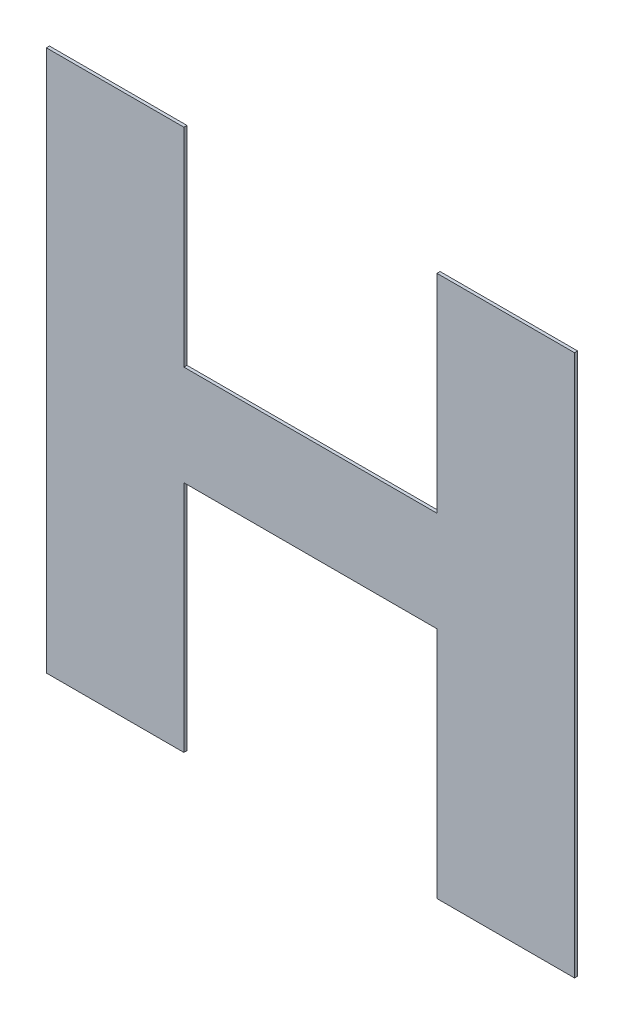
ISO-10303-21;
HEADER;
FILE_DESCRIPTION(('STEP AP214'),'2;1');
FILE_NAME('part.step','',(''),(''),'','','');
FILE_SCHEMA(('AUTOMOTIVE_DESIGN { 1 0 10303 214 1 1 1 1 }'));
ENDSEC;
DATA;
#1=APPLICATION_CONTEXT('core data for automotive mechanical design processes');
#2=APPLICATION_PROTOCOL_DEFINITION('international standard','automotive_design',2000,#1);
#3=PRODUCT_CONTEXT('',#1,'mechanical');
#4=PRODUCT('Part','Part','',(#3));
#5=PRODUCT_RELATED_PRODUCT_CATEGORY('part','',(#4));
#6=PRODUCT_DEFINITION_FORMATION('','',#4);
#7=PRODUCT_DEFINITION_CONTEXT('part definition',#1,'design');
#8=PRODUCT_DEFINITION('design','',#6,#7);
#9=PRODUCT_DEFINITION_SHAPE('','',#8);
#10=(LENGTH_UNIT() NAMED_UNIT(*) SI_UNIT(.MILLI.,.METRE.));
#11=(NAMED_UNIT(*) PLANE_ANGLE_UNIT() SI_UNIT($,.RADIAN.));
#12=(NAMED_UNIT(*) SI_UNIT($,.STERADIAN.) SOLID_ANGLE_UNIT());
#13=UNCERTAINTY_MEASURE_WITH_UNIT(LENGTH_MEASURE(1.E-05),#10,'distance_accuracy_value','');
#14=(GEOMETRIC_REPRESENTATION_CONTEXT(3) GLOBAL_UNCERTAINTY_ASSIGNED_CONTEXT((#13)) GLOBAL_UNIT_ASSIGNED_CONTEXT((#10,
#11,#12)) REPRESENTATION_CONTEXT('',''));
#15=CARTESIAN_POINT('',(0.,0.,0.));
#16=DIRECTION('',(0.,0.,1.));
#17=DIRECTION('',(1.,0.,0.));
#18=AXIS2_PLACEMENT_3D('',#15,#16,#17);
#19=CARTESIAN_POINT('',(-0.0645240321740251,0.7412429894471,0.0009));
#20=DIRECTION('',(0.,1.,0.));
#21=DIRECTION('',(0.,0.,1.));
#22=AXIS2_PLACEMENT_3D('',#19,#20,#21);
#23=PLANE('',#22);
#24=DIRECTION('',(0.,0.,1.));
#25=VECTOR('',#24,1.);
#26=CARTESIAN_POINT('',(-0.0845298786240001,0.7412429894471,0.));
#27=LINE('',#26,#25);
#28=CARTESIAN_POINT('',(-0.0845298786240001,0.7412429894471,0.));
#29=VERTEX_POINT('',#28);
#30=CARTESIAN_POINT('',(-0.0845298786240001,0.7412429894471,0.0009));
#31=VERTEX_POINT('',#30);
#32=EDGE_CURVE('E11',#29,#31,#27,.T.);
#33=ORIENTED_EDGE('',*,*,#32,.T.);
#34=DIRECTION('',(1.,0.,0.));
#35=VECTOR('',#34,1.);
#36=CARTESIAN_POINT('',(-0.0845298786240001,0.7412429894471,0.0009));
#37=LINE('',#36,#35);
#38=CARTESIAN_POINT('',(-0.0445181857240501,0.7412429894471,0.0009));
#39=VERTEX_POINT('',#38);
#40=EDGE_CURVE('E199',#31,#39,#37,.T.);
#41=ORIENTED_EDGE('',*,*,#40,.T.);
#42=DIRECTION('',(0.,0.,1.));
#43=VECTOR('',#42,1.);
#44=CARTESIAN_POINT('',(-0.0445181857240501,0.7412429894471,0.));
#45=LINE('',#44,#43);
#46=CARTESIAN_POINT('',(-0.0445181857240501,0.7412429894471,0.));
#47=VERTEX_POINT('',#46);
#48=EDGE_CURVE('E24',#47,#39,#45,.T.);
#49=ORIENTED_EDGE('',*,*,#48,.F.);
#50=DIRECTION('',(1.,0.,0.));
#51=VECTOR('',#50,1.);
#52=CARTESIAN_POINT('',(-0.0845298786240001,0.7412429894471,0.));
#53=LINE('',#52,#51);
#54=EDGE_CURVE('E188',#29,#47,#53,.T.);
#55=ORIENTED_EDGE('',*,*,#54,.F.);
#56=EDGE_LOOP('',(#33,#41,#49,#55));
#57=FACE_BOUND('',#56,.T.);
#58=ADVANCED_FACE('F17',(#57),#23,.T.);
#59=CARTESIAN_POINT('',(-0.0445181857240501,0.71101175133205,0.0009));
#60=DIRECTION('',(1.,0.,0.));
#61=DIRECTION('',(0.,0.,-1.));
#62=AXIS2_PLACEMENT_3D('',#59,#60,#61);
#63=PLANE('',#62);
#64=ORIENTED_EDGE('',*,*,#48,.T.);
#65=DIRECTION('',(0.,-1.,0.));
#66=VECTOR('',#65,1.);
#67=CARTESIAN_POINT('',(-0.0445181857240501,0.7412429894471,0.0009));
#68=LINE('',#67,#66);
#69=CARTESIAN_POINT('',(-0.0445181857240501,0.680780513216999,0.0009));
#70=VERTEX_POINT('',#69);
#71=EDGE_CURVE('E195',#39,#70,#68,.T.);
#72=ORIENTED_EDGE('',*,*,#71,.T.);
#73=DIRECTION('',(0.,0.,1.));
#74=VECTOR('',#73,1.);
#75=CARTESIAN_POINT('',(-0.0445181857240501,0.680780513216999,0.));
#76=LINE('',#75,#74);
#77=CARTESIAN_POINT('',(-0.0445181857240501,0.680780513216999,0.));
#78=VERTEX_POINT('',#77);
#79=EDGE_CURVE('E197',#78,#70,#76,.T.);
#80=ORIENTED_EDGE('',*,*,#79,.F.);
#81=DIRECTION('',(0.,-1.,0.));
#82=VECTOR('',#81,1.);
#83=CARTESIAN_POINT('',(-0.0445181857240501,0.7412429894471,0.));
#84=LINE('',#83,#82);
#85=EDGE_CURVE('E180',#47,#78,#84,.T.);
#86=ORIENTED_EDGE('',*,*,#85,.F.);
#87=EDGE_LOOP('',(#64,#72,#80,#86));
#88=FACE_BOUND('',#87,.T.);
#89=ADVANCED_FACE('F206',(#88),#63,.T.);
#90=CARTESIAN_POINT('',(-0.00768402012397513,0.680780513216999,0.0009));
#91=DIRECTION('',(0.,1.,0.));
#92=DIRECTION('',(0.,0.,1.));
#93=AXIS2_PLACEMENT_3D('',#90,#91,#92);
#94=PLANE('',#93);
#95=ORIENTED_EDGE('',*,*,#79,.T.);
#96=DIRECTION('',(1.,0.,0.));
#97=VECTOR('',#96,1.);
#98=CARTESIAN_POINT('',(-0.0445181857240501,0.680780513216999,0.0009));
#99=LINE('',#98,#97);
#100=CARTESIAN_POINT('',(0.0291501454760999,0.680780513216999,0.0009));
#101=VERTEX_POINT('',#100);
#102=EDGE_CURVE('E190',#70,#101,#99,.T.);
#103=ORIENTED_EDGE('',*,*,#102,.T.);
#104=DIRECTION('',(0.,0.,1.));
#105=VECTOR('',#104,1.);
#106=CARTESIAN_POINT('',(0.0291501454760999,0.680780513216999,0.));
#107=LINE('',#106,#105);
#108=CARTESIAN_POINT('',(0.0291501454760999,0.680780513216999,0.));
#109=VERTEX_POINT('',#108);
#110=EDGE_CURVE('E193',#109,#101,#107,.T.);
#111=ORIENTED_EDGE('',*,*,#110,.F.);
#112=DIRECTION('',(1.,0.,0.));
#113=VECTOR('',#112,1.);
#114=CARTESIAN_POINT('',(-0.0445181857240501,0.680780513216999,0.));
#115=LINE('',#114,#113);
#116=EDGE_CURVE('E172',#78,#109,#115,.T.);
#117=ORIENTED_EDGE('',*,*,#116,.F.);
#118=EDGE_LOOP('',(#95,#103,#111,#117));
#119=FACE_BOUND('',#118,.T.);
#120=ADVANCED_FACE('F209',(#119),#94,.T.);
#121=CARTESIAN_POINT('',(0.0291501454760999,0.71101175133205,0.0009));
#122=DIRECTION('',(-1.,0.,0.));
#123=DIRECTION('',(0.,0.,1.));
#124=AXIS2_PLACEMENT_3D('',#121,#122,#123);
#125=PLANE('',#124);
#126=ORIENTED_EDGE('',*,*,#110,.T.);
#127=DIRECTION('',(0.,1.,0.));
#128=VECTOR('',#127,1.);
#129=CARTESIAN_POINT('',(0.0291501454760999,0.680780513216999,0.0009));
#130=LINE('',#129,#128);
#131=CARTESIAN_POINT('',(0.0291501454760999,0.7412429894471,0.0009));
#132=VERTEX_POINT('',#131);
#133=EDGE_CURVE('E183',#101,#132,#130,.T.);
#134=ORIENTED_EDGE('',*,*,#133,.T.);
#135=DIRECTION('',(0.,0.,1.));
#136=VECTOR('',#135,1.);
#137=CARTESIAN_POINT('',(0.0291501454760999,0.7412429894471,0.));
#138=LINE('',#137,#136);
#139=CARTESIAN_POINT('',(0.0291501454760999,0.7412429894471,0.));
#140=VERTEX_POINT('',#139);
#141=EDGE_CURVE('E186',#140,#132,#138,.T.);
#142=ORIENTED_EDGE('',*,*,#141,.F.);
#143=DIRECTION('',(0.,1.,0.));
#144=VECTOR('',#143,1.);
#145=CARTESIAN_POINT('',(0.0291501454760999,0.680780513216999,0.));
#146=LINE('',#145,#144);
#147=EDGE_CURVE('E164',#109,#140,#146,.T.);
#148=ORIENTED_EDGE('',*,*,#147,.F.);
#149=EDGE_LOOP('',(#126,#134,#142,#148));
#150=FACE_BOUND('',#149,.T.);
#151=ADVANCED_FACE('F213',(#150),#125,.T.);
#152=CARTESIAN_POINT('',(0.0491620879259999,0.7412429894471,0.0009));
#153=DIRECTION('',(0.,1.,0.));
#154=DIRECTION('',(0.,0.,1.));
#155=AXIS2_PLACEMENT_3D('',#152,#153,#154);
#156=PLANE('',#155);
#157=ORIENTED_EDGE('',*,*,#141,.T.);
#158=DIRECTION('',(1.,0.,0.));
#159=VECTOR('',#158,1.);
#160=CARTESIAN_POINT('',(0.0291501454760999,0.7412429894471,0.0009));
#161=LINE('',#160,#159);
#162=CARTESIAN_POINT('',(0.0691740303758999,0.7412429894471,0.0009));
#163=VERTEX_POINT('',#162);
#164=EDGE_CURVE('E175',#132,#163,#161,.T.);
#165=ORIENTED_EDGE('',*,*,#164,.T.);
#166=DIRECTION('',(0.,0.,1.));
#167=VECTOR('',#166,1.);
#168=CARTESIAN_POINT('',(0.0691740303758999,0.7412429894471,0.));
#169=LINE('',#168,#167);
#170=CARTESIAN_POINT('',(0.0691740303758999,0.7412429894471,0.));
#171=VERTEX_POINT('',#170);
#172=EDGE_CURVE('E178',#171,#163,#169,.T.);
#173=ORIENTED_EDGE('',*,*,#172,.F.);
#174=DIRECTION('',(1.,0.,0.));
#175=VECTOR('',#174,1.);
#176=CARTESIAN_POINT('',(0.0291501454760999,0.7412429894471,0.));
#177=LINE('',#176,#175);
#178=EDGE_CURVE('E156',#140,#171,#177,.T.);
#179=ORIENTED_EDGE('',*,*,#178,.F.);
#180=EDGE_LOOP('',(#157,#165,#173,#179));
#181=FACE_BOUND('',#180,.T.);
#182=ADVANCED_FACE('F216',(#181),#156,.T.);
#183=CARTESIAN_POINT('',(0.0691740303758999,0.662452825082,0.0009));
#184=DIRECTION('',(1.,0.,0.));
#185=DIRECTION('',(0.,0.,-1.));
#186=AXIS2_PLACEMENT_3D('',#183,#184,#185);
#187=PLANE('',#186);
#188=ORIENTED_EDGE('',*,*,#172,.T.);
#189=DIRECTION('',(0.,-1.,0.));
#190=VECTOR('',#189,1.);
#191=CARTESIAN_POINT('',(0.0691740303758999,0.7412429894471,0.0009));
#192=LINE('',#191,#190);
#193=CARTESIAN_POINT('',(0.0691740303758999,0.5836626607169,0.0009));
#194=VERTEX_POINT('',#193);
#195=EDGE_CURVE('E167',#163,#194,#192,.T.);
#196=ORIENTED_EDGE('',*,*,#195,.T.);
#197=DIRECTION('',(0.,0.,1.));
#198=VECTOR('',#197,1.);
#199=CARTESIAN_POINT('',(0.0691740303758999,0.5836626607169,0.));
#200=LINE('',#199,#198);
#201=CARTESIAN_POINT('',(0.0691740303758999,0.5836626607169,0.));
#202=VERTEX_POINT('',#201);
#203=EDGE_CURVE('E170',#202,#194,#200,.T.);
#204=ORIENTED_EDGE('',*,*,#203,.F.);
#205=DIRECTION('',(0.,-1.,0.));
#206=VECTOR('',#205,1.);
#207=CARTESIAN_POINT('',(0.0691740303758999,0.7412429894471,0.));
#208=LINE('',#207,#206);
#209=EDGE_CURVE('E148',#171,#202,#208,.T.);
#210=ORIENTED_EDGE('',*,*,#209,.F.);
#211=EDGE_LOOP('',(#188,#196,#204,#210));
#212=FACE_BOUND('',#211,.T.);
#213=ADVANCED_FACE('F220',(#212),#187,.T.);
#214=CARTESIAN_POINT('',(0.0491620879259999,0.5836626607169,0.0009));
#215=DIRECTION('',(0.,-1.,0.));
#216=DIRECTION('',(0.,0.,-1.));
#217=AXIS2_PLACEMENT_3D('',#214,#215,#216);
#218=PLANE('',#217);
#219=ORIENTED_EDGE('',*,*,#203,.T.);
#220=DIRECTION('',(-1.,0.,0.));
#221=VECTOR('',#220,1.);
#222=CARTESIAN_POINT('',(0.0691740303758999,0.5836626607169,0.0009));
#223=LINE('',#222,#221);
#224=CARTESIAN_POINT('',(0.0291501454760999,0.5836626607169,0.0009));
#225=VERTEX_POINT('',#224);
#226=EDGE_CURVE('E159',#194,#225,#223,.T.);
#227=ORIENTED_EDGE('',*,*,#226,.T.);
#228=DIRECTION('',(0.,0.,1.));
#229=VECTOR('',#228,1.);
#230=CARTESIAN_POINT('',(0.0291501454760999,0.5836626607169,0.));
#231=LINE('',#230,#229);
#232=CARTESIAN_POINT('',(0.0291501454760999,0.5836626607169,0.));
#233=VERTEX_POINT('',#232);
#234=EDGE_CURVE('E162',#233,#225,#231,.T.);
#235=ORIENTED_EDGE('',*,*,#234,.F.);
#236=DIRECTION('',(-1.,0.,0.));
#237=VECTOR('',#236,1.);
#238=CARTESIAN_POINT('',(0.0691740303758999,0.5836626607169,0.));
#239=LINE('',#238,#237);
#240=EDGE_CURVE('E140',#202,#233,#239,.T.);
#241=ORIENTED_EDGE('',*,*,#240,.F.);
#242=EDGE_LOOP('',(#219,#227,#235,#241));
#243=FACE_BOUND('',#242,.T.);
#244=ADVANCED_FACE('F224',(#243),#218,.T.);
#245=CARTESIAN_POINT('',(0.0291501454760999,0.617654518056949,0.0009));
#246=DIRECTION('',(-1.,0.,0.));
#247=DIRECTION('',(0.,0.,1.));
#248=AXIS2_PLACEMENT_3D('',#245,#246,#247);
#249=PLANE('',#248);
#250=ORIENTED_EDGE('',*,*,#234,.T.);
#251=DIRECTION('',(0.,1.,0.));
#252=VECTOR('',#251,1.);
#253=CARTESIAN_POINT('',(0.0291501454760999,0.5836626607169,0.0009));
#254=LINE('',#253,#252);
#255=CARTESIAN_POINT('',(0.0291501454760999,0.651646375396997,0.0009));
#256=VERTEX_POINT('',#255);
#257=EDGE_CURVE('E151',#225,#256,#254,.T.);
#258=ORIENTED_EDGE('',*,*,#257,.T.);
#259=DIRECTION('',(0.,0.,1.));
#260=VECTOR('',#259,1.);
#261=CARTESIAN_POINT('',(0.0291501454760999,0.651646375396997,0.));
#262=LINE('',#261,#260);
#263=CARTESIAN_POINT('',(0.0291501454760999,0.651646375396997,0.));
#264=VERTEX_POINT('',#263);
#265=EDGE_CURVE('E154',#264,#256,#262,.T.);
#266=ORIENTED_EDGE('',*,*,#265,.F.);
#267=DIRECTION('',(0.,1.,0.));
#268=VECTOR('',#267,1.);
#269=CARTESIAN_POINT('',(0.0291501454760999,0.5836626607169,0.));
#270=LINE('',#269,#268);
#271=EDGE_CURVE('E113',#233,#264,#270,.T.);
#272=ORIENTED_EDGE('',*,*,#271,.F.);
#273=EDGE_LOOP('',(#250,#258,#266,#272));
#274=FACE_BOUND('',#273,.T.);
#275=ADVANCED_FACE('F228',(#274),#249,.T.);
#276=CARTESIAN_POINT('',(-0.00768402012397513,0.651646375396997,0.0009));
#277=DIRECTION('',(0.,-1.,0.));
#278=DIRECTION('',(0.,0.,-1.));
#279=AXIS2_PLACEMENT_3D('',#276,#277,#278);
#280=PLANE('',#279);
#281=ORIENTED_EDGE('',*,*,#265,.T.);
#282=DIRECTION('',(-1.,0.,0.));
#283=VECTOR('',#282,1.);
#284=CARTESIAN_POINT('',(0.0291501454760999,0.651646375396997,0.0009));
#285=LINE('',#284,#283);
#286=CARTESIAN_POINT('',(-0.0445181857240501,0.651646375396997,0.0009));
#287=VERTEX_POINT('',#286);
#288=EDGE_CURVE('E143',#256,#287,#285,.T.);
#289=ORIENTED_EDGE('',*,*,#288,.T.);
#290=DIRECTION('',(0.,0.,1.));
#291=VECTOR('',#290,1.);
#292=CARTESIAN_POINT('',(-0.0445181857240501,0.651646375396997,0.));
#293=LINE('',#292,#291);
#294=CARTESIAN_POINT('',(-0.0445181857240501,0.651646375396997,0.));
#295=VERTEX_POINT('',#294);
#296=EDGE_CURVE('E146',#295,#287,#293,.T.);
#297=ORIENTED_EDGE('',*,*,#296,.F.);
#298=DIRECTION('',(-1.,0.,0.));
#299=VECTOR('',#298,1.);
#300=CARTESIAN_POINT('',(0.0291501454760999,0.651646375396997,0.));
#301=LINE('',#300,#299);
#302=EDGE_CURVE('E130',#264,#295,#301,.T.);
#303=ORIENTED_EDGE('',*,*,#302,.F.);
#304=EDGE_LOOP('',(#281,#289,#297,#303));
#305=FACE_BOUND('',#304,.T.);
#306=ADVANCED_FACE('F232',(#305),#280,.T.);
#307=CARTESIAN_POINT('',(-0.0445181857240501,0.617654518056949,0.0009));
#308=DIRECTION('',(1.,0.,0.));
#309=DIRECTION('',(0.,0.,-1.));
#310=AXIS2_PLACEMENT_3D('',#307,#308,#309);
#311=PLANE('',#310);
#312=ORIENTED_EDGE('',*,*,#296,.T.);
#313=DIRECTION('',(0.,-1.,0.));
#314=VECTOR('',#313,1.);
#315=CARTESIAN_POINT('',(-0.0445181857240501,0.651646375396997,0.0009));
#316=LINE('',#315,#314);
#317=CARTESIAN_POINT('',(-0.0445181857240501,0.5836626607169,0.0009));
#318=VERTEX_POINT('',#317);
#319=EDGE_CURVE('E135',#287,#318,#316,.T.);
#320=ORIENTED_EDGE('',*,*,#319,.T.);
#321=DIRECTION('',(0.,0.,1.));
#322=VECTOR('',#321,1.);
#323=CARTESIAN_POINT('',(-0.0445181857240501,0.5836626607169,0.));
#324=LINE('',#323,#322);
#325=CARTESIAN_POINT('',(-0.0445181857240501,0.5836626607169,0.));
#326=VERTEX_POINT('',#325);
#327=EDGE_CURVE('E138',#326,#318,#324,.T.);
#328=ORIENTED_EDGE('',*,*,#327,.F.);
#329=DIRECTION('',(0.,-1.,0.));
#330=VECTOR('',#329,1.);
#331=CARTESIAN_POINT('',(-0.0445181857240501,0.651646375396997,0.));
#332=LINE('',#331,#330);
#333=EDGE_CURVE('E124',#295,#326,#332,.T.);
#334=ORIENTED_EDGE('',*,*,#333,.F.);
#335=EDGE_LOOP('',(#312,#320,#328,#334));
#336=FACE_BOUND('',#335,.T.);
#337=ADVANCED_FACE('F235',(#336),#311,.T.);
#338=CARTESIAN_POINT('',(-0.0645240321740251,0.5836626607169,0.0009));
#339=DIRECTION('',(0.,-1.,0.));
#340=DIRECTION('',(0.,0.,-1.));
#341=AXIS2_PLACEMENT_3D('',#338,#339,#340);
#342=PLANE('',#341);
#343=ORIENTED_EDGE('',*,*,#327,.T.);
#344=DIRECTION('',(-1.,0.,0.));
#345=VECTOR('',#344,1.);
#346=CARTESIAN_POINT('',(-0.0445181857240501,0.5836626607169,0.0009));
#347=LINE('',#346,#345);
#348=CARTESIAN_POINT('',(-0.0845298786240001,0.5836626607169,0.0009));
#349=VERTEX_POINT('',#348);
#350=EDGE_CURVE('E110',#318,#349,#347,.T.);
#351=ORIENTED_EDGE('',*,*,#350,.T.);
#352=DIRECTION('',(0.,0.,1.));
#353=VECTOR('',#352,1.);
#354=CARTESIAN_POINT('',(-0.0845298786240001,0.5836626607169,0.));
#355=LINE('',#354,#353);
#356=CARTESIAN_POINT('',(-0.0845298786240001,0.5836626607169,0.));
#357=VERTEX_POINT('',#356);
#358=EDGE_CURVE('E103',#357,#349,#355,.T.);
#359=ORIENTED_EDGE('',*,*,#358,.F.);
#360=DIRECTION('',(-1.,0.,0.));
#361=VECTOR('',#360,1.);
#362=CARTESIAN_POINT('',(-0.0445181857240501,0.5836626607169,0.));
#363=LINE('',#362,#361);
#364=EDGE_CURVE('E107',#326,#357,#363,.T.);
#365=ORIENTED_EDGE('',*,*,#364,.F.);
#366=EDGE_LOOP('',(#343,#351,#359,#365));
#367=FACE_BOUND('',#366,.T.);
#368=ADVANCED_FACE('F105',(#367),#342,.T.);
#369=CARTESIAN_POINT('',(-0.0845298786240001,0.662452825082,0.0009));
#370=DIRECTION('',(-1.,0.,0.));
#371=DIRECTION('',(0.,0.,1.));
#372=AXIS2_PLACEMENT_3D('',#369,#370,#371);
#373=PLANE('',#372);
#374=ORIENTED_EDGE('',*,*,#358,.T.);
#375=DIRECTION('',(0.,1.,0.));
#376=VECTOR('',#375,1.);
#377=CARTESIAN_POINT('',(-0.0845298786240001,0.5836626607169,0.0009));
#378=LINE('',#377,#376);
#379=EDGE_CURVE('E126',#349,#31,#378,.T.);
#380=ORIENTED_EDGE('',*,*,#379,.T.);
#381=ORIENTED_EDGE('',*,*,#32,.F.);
#382=DIRECTION('',(0.,1.,0.));
#383=VECTOR('',#382,1.);
#384=CARTESIAN_POINT('',(-0.0845298786240001,0.5836626607169,0.));
#385=LINE('',#384,#383);
#386=EDGE_CURVE('E116',#357,#29,#385,.T.);
#387=ORIENTED_EDGE('',*,*,#386,.F.);
#388=EDGE_LOOP('',(#374,#380,#381,#387));
#389=FACE_BOUND('',#388,.T.);
#390=ADVANCED_FACE('F117',(#389),#373,.T.);
#391=CARTESIAN_POINT('',(-0.00767792412405013,0.5836626607169,0.));
#392=DIRECTION('',(0.,0.,1.));
#393=DIRECTION('',(1.,0.,0.));
#394=AXIS2_PLACEMENT_3D('',#391,#392,#393);
#395=PLANE('',#394);
#396=ORIENTED_EDGE('',*,*,#54,.T.);
#397=ORIENTED_EDGE('',*,*,#85,.T.);
#398=ORIENTED_EDGE('',*,*,#116,.T.);
#399=ORIENTED_EDGE('',*,*,#147,.T.);
#400=ORIENTED_EDGE('',*,*,#178,.T.);
#401=ORIENTED_EDGE('',*,*,#209,.T.);
#402=ORIENTED_EDGE('',*,*,#240,.T.);
#403=ORIENTED_EDGE('',*,*,#271,.T.);
#404=ORIENTED_EDGE('',*,*,#302,.T.);
#405=ORIENTED_EDGE('',*,*,#333,.T.);
#406=ORIENTED_EDGE('',*,*,#364,.T.);
#407=ORIENTED_EDGE('',*,*,#386,.T.);
#408=EDGE_LOOP('',(#396,#397,#398,#399,#400,#401,#402,#403,#404,#405,#406,#407));
#409=FACE_BOUND('',#408,.T.);
#410=ADVANCED_FACE('F121',(#409),#395,.F.);
#411=CARTESIAN_POINT('',(-0.00767792412405013,0.5836626607169,0.0009));
#412=DIRECTION('',(0.,0.,1.));
#413=DIRECTION('',(1.,0.,0.));
#414=AXIS2_PLACEMENT_3D('',#411,#412,#413);
#415=PLANE('',#414);
#416=ORIENTED_EDGE('',*,*,#40,.F.);
#417=ORIENTED_EDGE('',*,*,#379,.F.);
#418=ORIENTED_EDGE('',*,*,#350,.F.);
#419=ORIENTED_EDGE('',*,*,#319,.F.);
#420=ORIENTED_EDGE('',*,*,#288,.F.);
#421=ORIENTED_EDGE('',*,*,#257,.F.);
#422=ORIENTED_EDGE('',*,*,#226,.F.);
#423=ORIENTED_EDGE('',*,*,#195,.F.);
#424=ORIENTED_EDGE('',*,*,#164,.F.);
#425=ORIENTED_EDGE('',*,*,#133,.F.);
#426=ORIENTED_EDGE('',*,*,#102,.F.);
#427=ORIENTED_EDGE('',*,*,#71,.F.);
#428=EDGE_LOOP('',(#416,#417,#418,#419,#420,#421,#422,#423,#424,#425,#426,#427));
#429=FACE_BOUND('',#428,.T.);
#430=ADVANCED_FACE('F204',(#429),#415,.T.);
#431=CLOSED_SHELL('',(#58,#89,#120,#151,#182,#213,#244,#275,#306,#337,#368,#390,#410,#430));
#432=MANIFOLD_SOLID_BREP('B1',#431);
#433=ADVANCED_BREP_SHAPE_REPRESENTATION('',(#18,#432),#14);
#434=SHAPE_DEFINITION_REPRESENTATION(#9,#433);
ENDSEC;
END-ISO-10303-21;
